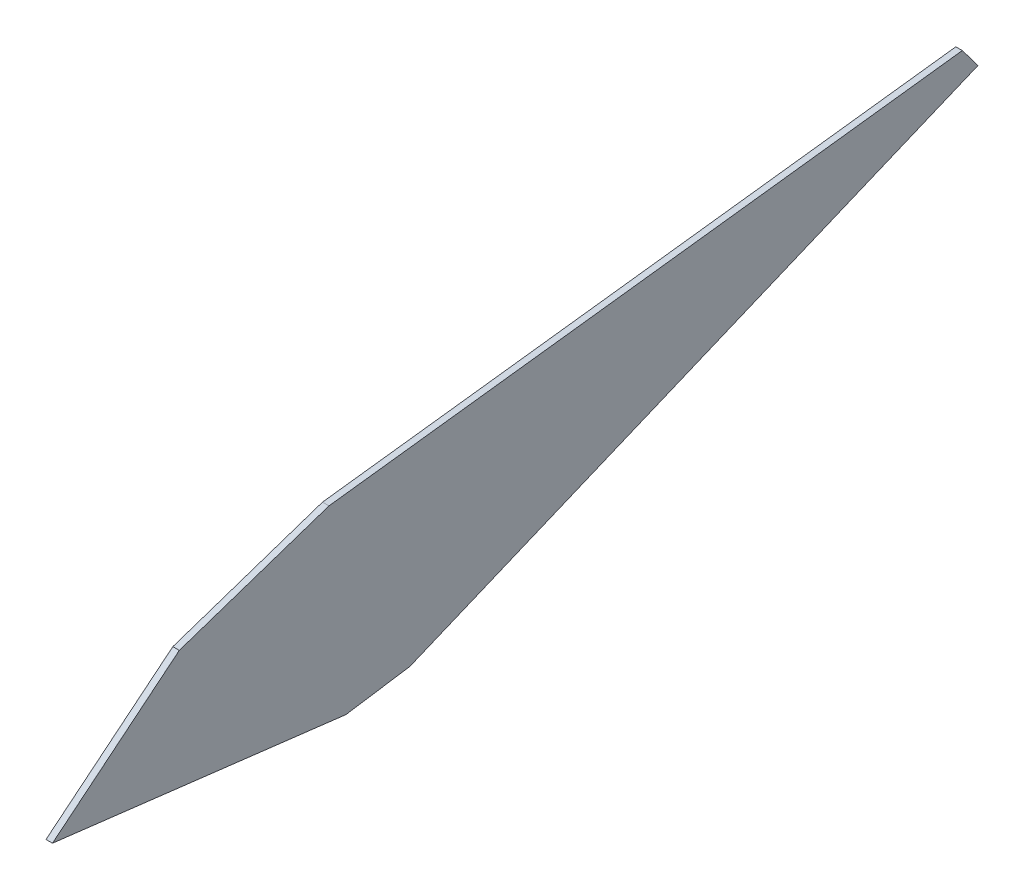
ISO-10303-21;
HEADER;
FILE_DESCRIPTION(('STEP AP214'),'2;1');
FILE_NAME('part.step','',(''),(''),'','','');
FILE_SCHEMA(('AUTOMOTIVE_DESIGN { 1 0 10303 214 1 1 1 1 }'));
ENDSEC;
DATA;
#1=APPLICATION_CONTEXT('core data for automotive mechanical design processes');
#2=APPLICATION_PROTOCOL_DEFINITION('international standard','automotive_design',2000,#1);
#3=PRODUCT_CONTEXT('',#1,'mechanical');
#4=PRODUCT('Part','Part','',(#3));
#5=PRODUCT_RELATED_PRODUCT_CATEGORY('part','',(#4));
#6=PRODUCT_DEFINITION_FORMATION('','',#4);
#7=PRODUCT_DEFINITION_CONTEXT('part definition',#1,'design');
#8=PRODUCT_DEFINITION('design','',#6,#7);
#9=PRODUCT_DEFINITION_SHAPE('','',#8);
#10=(LENGTH_UNIT() NAMED_UNIT(*) SI_UNIT(.MILLI.,.METRE.));
#11=(NAMED_UNIT(*) PLANE_ANGLE_UNIT() SI_UNIT($,.RADIAN.));
#12=(NAMED_UNIT(*) SI_UNIT($,.STERADIAN.) SOLID_ANGLE_UNIT());
#13=UNCERTAINTY_MEASURE_WITH_UNIT(LENGTH_MEASURE(1.E-05),#10,'distance_accuracy_value','');
#14=(GEOMETRIC_REPRESENTATION_CONTEXT(3) GLOBAL_UNCERTAINTY_ASSIGNED_CONTEXT((#13)) GLOBAL_UNIT_ASSIGNED_CONTEXT((#10,
#11,#12)) REPRESENTATION_CONTEXT('',''));
#15=CARTESIAN_POINT('',(0.,0.,0.));
#16=DIRECTION('',(0.,0.,1.));
#17=DIRECTION('',(1.,0.,0.));
#18=AXIS2_PLACEMENT_3D('',#15,#16,#17);
#19=CARTESIAN_POINT('',(0.635,-17.46504,30.30982));
#20=DIRECTION('',(0.,0.923267357697167,0.384158022447652));
#21=DIRECTION('',(0.,-0.384158022447652,0.923267357697168));
#22=AXIS2_PLACEMENT_3D('',#19,#20,#21);
#23=PLANE('',#22);
#24=DIRECTION('',(0.,0.384158022447652,-0.923267357697168));
#25=VECTOR('',#24,1.);
#26=CARTESIAN_POINT('',(0.,-17.46504,30.30982));
#27=LINE('',#26,#25);
#28=CARTESIAN_POINT('',(0.,-17.46504,30.30982));
#29=VERTEX_POINT('',#28);
#30=CARTESIAN_POINT('',(0.,5.715,-25.4));
#31=VERTEX_POINT('',#30);
#32=EDGE_CURVE('E122',#29,#31,#27,.T.);
#33=ORIENTED_EDGE('',*,*,#32,.T.);
#34=DIRECTION('',(-1.,0.,0.));
#35=VECTOR('',#34,1.);
#36=CARTESIAN_POINT('',(0.635,5.715,-25.4));
#37=LINE('',#36,#35);
#38=CARTESIAN_POINT('',(0.635,5.715,-25.4));
#39=VERTEX_POINT('',#38);
#40=EDGE_CURVE('E11',#39,#31,#37,.T.);
#41=ORIENTED_EDGE('',*,*,#40,.F.);
#42=DIRECTION('',(0.,0.384158022447652,-0.923267357697168));
#43=VECTOR('',#42,1.);
#44=CARTESIAN_POINT('',(0.635,-17.46504,30.30982));
#45=LINE('',#44,#43);
#46=CARTESIAN_POINT('',(0.635,-17.46504,30.30982));
#47=VERTEX_POINT('',#46);
#48=EDGE_CURVE('E134',#47,#39,#45,.T.);
#49=ORIENTED_EDGE('',*,*,#48,.F.);
#50=DIRECTION('',(-1.,0.,0.));
#51=VECTOR('',#50,1.);
#52=CARTESIAN_POINT('',(0.635,-17.46504,30.30982));
#53=LINE('',#52,#51);
#54=EDGE_CURVE('E118',#47,#29,#53,.T.);
#55=ORIENTED_EDGE('',*,*,#54,.T.);
#56=EDGE_LOOP('',(#33,#41,#49,#55));
#57=FACE_BOUND('',#56,.T.);
#58=ADVANCED_FACE('F32',(#57),#23,.F.);
#59=CARTESIAN_POINT('',(0.635,5.715,-25.4));
#60=DIRECTION('',(0.,-0.601905322033391,0.798567456955191));
#61=DIRECTION('',(0.,-0.798567456955191,-0.601905322033391));
#62=AXIS2_PLACEMENT_3D('',#59,#60,#61);
#63=PLANE('',#62);
#64=DIRECTION('',(0.,0.798567456955191,0.601905322033391));
#65=VECTOR('',#64,1.);
#66=CARTESIAN_POINT('',(0.,5.715,-25.4));
#67=LINE('',#66,#65);
#68=CARTESIAN_POINT('',(0.,7.75716,-23.86076));
#69=VERTEX_POINT('',#68);
#70=EDGE_CURVE('E125',#31,#69,#67,.T.);
#71=ORIENTED_EDGE('',*,*,#70,.T.);
#72=DIRECTION('',(-1.,0.,0.));
#73=VECTOR('',#72,1.);
#74=CARTESIAN_POINT('',(0.635,7.75716,-23.86076));
#75=LINE('',#74,#73);
#76=CARTESIAN_POINT('',(0.635,7.75716,-23.86076));
#77=VERTEX_POINT('',#76);
#78=EDGE_CURVE('E40',#77,#69,#75,.T.);
#79=ORIENTED_EDGE('',*,*,#78,.F.);
#80=DIRECTION('',(0.,0.798567456955191,0.601905322033391));
#81=VECTOR('',#80,1.);
#82=CARTESIAN_POINT('',(0.635,5.715,-25.4));
#83=LINE('',#82,#81);
#84=EDGE_CURVE('E88',#39,#77,#83,.T.);
#85=ORIENTED_EDGE('',*,*,#84,.F.);
#86=ORIENTED_EDGE('',*,*,#40,.T.);
#87=EDGE_LOOP('',(#71,#79,#85,#86));
#88=FACE_BOUND('',#87,.T.);
#89=ADVANCED_FACE('F159',(#88),#63,.F.);
#90=CARTESIAN_POINT('',(0.635,7.75716,-23.86076));
#91=DIRECTION('',(0.,-0.992563085406152,-0.121731349655791));
#92=DIRECTION('',(0.,0.121731349655791,-0.992563085406152));
#93=AXIS2_PLACEMENT_3D('',#90,#91,#92);
#94=PLANE('',#93);
#95=DIRECTION('',(0.,-0.121731349655791,0.992563085406152));
#96=VECTOR('',#95,1.);
#97=CARTESIAN_POINT('',(0.,7.75716,-23.86076));
#98=LINE('',#97,#96);
#99=CARTESIAN_POINT('',(0.,0.1397,38.24986));
#100=VERTEX_POINT('',#99);
#101=EDGE_CURVE('E127',#69,#100,#98,.T.);
#102=ORIENTED_EDGE('',*,*,#101,.T.);
#103=DIRECTION('',(-1.,0.,0.));
#104=VECTOR('',#103,1.);
#105=CARTESIAN_POINT('',(0.635,0.1397,38.24986));
#106=LINE('',#105,#104);
#107=CARTESIAN_POINT('',(0.635,0.1397,38.24986));
#108=VERTEX_POINT('',#107);
#109=EDGE_CURVE('E138',#108,#100,#106,.T.);
#110=ORIENTED_EDGE('',*,*,#109,.F.);
#111=DIRECTION('',(0.,-0.121731349655791,0.992563085406152));
#112=VECTOR('',#111,1.);
#113=CARTESIAN_POINT('',(0.635,7.75716,-23.86076));
#114=LINE('',#113,#112);
#115=EDGE_CURVE('E146',#77,#108,#114,.T.);
#116=ORIENTED_EDGE('',*,*,#115,.F.);
#117=ORIENTED_EDGE('',*,*,#78,.T.);
#118=EDGE_LOOP('',(#102,#110,#116,#117));
#119=FACE_BOUND('',#118,.T.);
#120=ADVANCED_FACE('F144',(#119),#94,.F.);
#121=CARTESIAN_POINT('',(0.635,0.1397,38.24986));
#122=DIRECTION('',(0.,-0.947876671886927,-0.318637434857491));
#123=DIRECTION('',(0.,0.318637434857491,-0.947876671886927));
#124=AXIS2_PLACEMENT_3D('',#121,#122,#123);
#125=PLANE('',#124);
#126=DIRECTION('',(0.,-0.318637434857491,0.947876671886928));
#127=VECTOR('',#126,1.);
#128=CARTESIAN_POINT('',(0.,0.1397,38.24986));
#129=LINE('',#128,#127);
#130=CARTESIAN_POINT('',(0.,-4.79552,52.93106));
#131=VERTEX_POINT('',#130);
#132=EDGE_CURVE('E129',#100,#131,#129,.T.);
#133=ORIENTED_EDGE('',*,*,#132,.T.);
#134=DIRECTION('',(-1.,0.,0.));
#135=VECTOR('',#134,1.);
#136=CARTESIAN_POINT('',(0.635,-4.79552,52.93106));
#137=LINE('',#136,#135);
#138=CARTESIAN_POINT('',(0.635,-4.79552,52.93106));
#139=VERTEX_POINT('',#138);
#140=EDGE_CURVE('E113',#139,#131,#137,.T.);
#141=ORIENTED_EDGE('',*,*,#140,.F.);
#142=DIRECTION('',(0.,-0.318637434857491,0.947876671886928));
#143=VECTOR('',#142,1.);
#144=CARTESIAN_POINT('',(0.635,0.1397,38.24986));
#145=LINE('',#144,#143);
#146=EDGE_CURVE('E104',#108,#139,#145,.T.);
#147=ORIENTED_EDGE('',*,*,#146,.F.);
#148=ORIENTED_EDGE('',*,*,#109,.T.);
#149=EDGE_LOOP('',(#133,#141,#147,#148));
#150=FACE_BOUND('',#149,.T.);
#151=ADVANCED_FACE('F152',(#150),#125,.F.);
#152=CARTESIAN_POINT('',(0.635,-4.79552,52.93106));
#153=DIRECTION('',(0.,-0.77447143004225,-0.632608887108229));
#154=DIRECTION('',(0.,0.632608887108229,-0.77447143004225));
#155=AXIS2_PLACEMENT_3D('',#152,#153,#154);
#156=PLANE('',#155);
#157=DIRECTION('',(0.,-0.632608887108229,0.77447143004225));
#158=VECTOR('',#157,1.);
#159=CARTESIAN_POINT('',(0.,-4.79552,52.93106));
#160=LINE('',#159,#158);
#161=CARTESIAN_POINT('',(0.,-14.95552,65.36944));
#162=VERTEX_POINT('',#161);
#163=EDGE_CURVE('E112',#131,#162,#160,.T.);
#164=ORIENTED_EDGE('',*,*,#163,.T.);
#165=DIRECTION('',(-1.,0.,0.));
#166=VECTOR('',#165,1.);
#167=CARTESIAN_POINT('',(0.635,-14.95552,65.36944));
#168=LINE('',#167,#166);
#169=CARTESIAN_POINT('',(0.635,-14.95552,65.36944));
#170=VERTEX_POINT('',#169);
#171=EDGE_CURVE('E109',#170,#162,#168,.T.);
#172=ORIENTED_EDGE('',*,*,#171,.F.);
#173=DIRECTION('',(0.,-0.632608887108229,0.77447143004225));
#174=VECTOR('',#173,1.);
#175=CARTESIAN_POINT('',(0.635,-4.79552,52.93106));
#176=LINE('',#175,#174);
#177=EDGE_CURVE('E98',#139,#170,#176,.T.);
#178=ORIENTED_EDGE('',*,*,#177,.F.);
#179=ORIENTED_EDGE('',*,*,#140,.T.);
#180=EDGE_LOOP('',(#164,#172,#178,#179));
#181=FACE_BOUND('',#180,.T.);
#182=ADVANCED_FACE('F110',(#181),#156,.F.);
#183=CARTESIAN_POINT('',(0.635,-14.95552,65.36944));
#184=DIRECTION('',(0.,0.992823258998328,-0.11959087085534));
#185=DIRECTION('',(0.,0.11959087085534,0.992823258998328));
#186=AXIS2_PLACEMENT_3D('',#183,#184,#185);
#187=PLANE('',#186);
#188=DIRECTION('',(0.,-0.11959087085534,-0.992823258998328));
#189=VECTOR('',#188,1.);
#190=CARTESIAN_POINT('',(0.,-14.95552,65.36944));
#191=LINE('',#190,#189);
#192=CARTESIAN_POINT('',(0.,-18.42262,36.58616));
#193=VERTEX_POINT('',#192);
#194=EDGE_CURVE('E74',#162,#193,#191,.T.);
#195=ORIENTED_EDGE('',*,*,#194,.T.);
#196=DIRECTION('',(-1.,0.,0.));
#197=VECTOR('',#196,1.);
#198=CARTESIAN_POINT('',(0.635,-18.42262,36.58616));
#199=LINE('',#198,#197);
#200=CARTESIAN_POINT('',(0.635,-18.42262,36.58616));
#201=VERTEX_POINT('',#200);
#202=EDGE_CURVE('E114',#201,#193,#199,.T.);
#203=ORIENTED_EDGE('',*,*,#202,.F.);
#204=DIRECTION('',(0.,-0.11959087085534,-0.992823258998328));
#205=VECTOR('',#204,1.);
#206=CARTESIAN_POINT('',(0.635,-14.95552,65.36944));
#207=LINE('',#206,#205);
#208=EDGE_CURVE('E102',#170,#201,#207,.T.);
#209=ORIENTED_EDGE('',*,*,#208,.F.);
#210=ORIENTED_EDGE('',*,*,#171,.T.);
#211=EDGE_LOOP('',(#195,#203,#209,#210));
#212=FACE_BOUND('',#211,.T.);
#213=ADVANCED_FACE('F116',(#212),#187,.F.);
#214=CARTESIAN_POINT('',(0.635,-18.42262,36.58616));
#215=DIRECTION('',(0.,0.988560555272323,0.15082449588736));
#216=DIRECTION('',(0.,-0.15082449588736,0.988560555272323));
#217=AXIS2_PLACEMENT_3D('',#214,#215,#216);
#218=PLANE('',#217);
#219=DIRECTION('',(0.,0.15082449588736,-0.988560555272323));
#220=VECTOR('',#219,1.);
#221=CARTESIAN_POINT('',(0.,-18.42262,36.58616));
#222=LINE('',#221,#220);
#223=EDGE_CURVE('E80',#193,#29,#222,.T.);
#224=ORIENTED_EDGE('',*,*,#223,.T.);
#225=ORIENTED_EDGE('',*,*,#54,.F.);
#226=DIRECTION('',(0.,0.15082449588736,-0.988560555272323));
#227=VECTOR('',#226,1.);
#228=CARTESIAN_POINT('',(0.635,-18.42262,36.58616));
#229=LINE('',#228,#227);
#230=EDGE_CURVE('E48',#201,#47,#229,.T.);
#231=ORIENTED_EDGE('',*,*,#230,.F.);
#232=ORIENTED_EDGE('',*,*,#202,.T.);
#233=EDGE_LOOP('',(#224,#225,#231,#232));
#234=FACE_BOUND('',#233,.T.);
#235=ADVANCED_FACE('F173',(#234),#218,.F.);
#236=CARTESIAN_POINT('',(0.635,0.,0.));
#237=DIRECTION('',(1.,0.,0.));
#238=DIRECTION('',(0.,0.,-1.));
#239=AXIS2_PLACEMENT_3D('',#236,#237,#238);
#240=PLANE('',#239);
#241=ORIENTED_EDGE('',*,*,#48,.T.);
#242=ORIENTED_EDGE('',*,*,#84,.T.);
#243=ORIENTED_EDGE('',*,*,#115,.T.);
#244=ORIENTED_EDGE('',*,*,#146,.T.);
#245=ORIENTED_EDGE('',*,*,#177,.T.);
#246=ORIENTED_EDGE('',*,*,#208,.T.);
#247=ORIENTED_EDGE('',*,*,#230,.T.);
#248=EDGE_LOOP('',(#241,#242,#243,#244,#245,#246,#247));
#249=FACE_BOUND('',#248,.T.);
#250=ADVANCED_FACE('F100',(#249),#240,.T.);
#251=CARTESIAN_POINT('',(0.,0.,0.));
#252=DIRECTION('',(1.,0.,0.));
#253=DIRECTION('',(0.,0.,-1.));
#254=AXIS2_PLACEMENT_3D('',#251,#252,#253);
#255=PLANE('',#254);
#256=ORIENTED_EDGE('',*,*,#32,.F.);
#257=ORIENTED_EDGE('',*,*,#223,.F.);
#258=ORIENTED_EDGE('',*,*,#194,.F.);
#259=ORIENTED_EDGE('',*,*,#163,.F.);
#260=ORIENTED_EDGE('',*,*,#132,.F.);
#261=ORIENTED_EDGE('',*,*,#101,.F.);
#262=ORIENTED_EDGE('',*,*,#70,.F.);
#263=EDGE_LOOP('',(#256,#257,#258,#259,#260,#261,#262));
#264=FACE_BOUND('',#263,.T.);
#265=ADVANCED_FACE('F150',(#264),#255,.F.);
#266=CLOSED_SHELL('',(#58,#89,#120,#151,#182,#213,#235,#250,#265));
#267=MANIFOLD_SOLID_BREP('B2',#266);
#268=ADVANCED_BREP_SHAPE_REPRESENTATION('',(#18,#267),#14);
#269=SHAPE_DEFINITION_REPRESENTATION(#9,#268);
ENDSEC;
END-ISO-10303-21;
